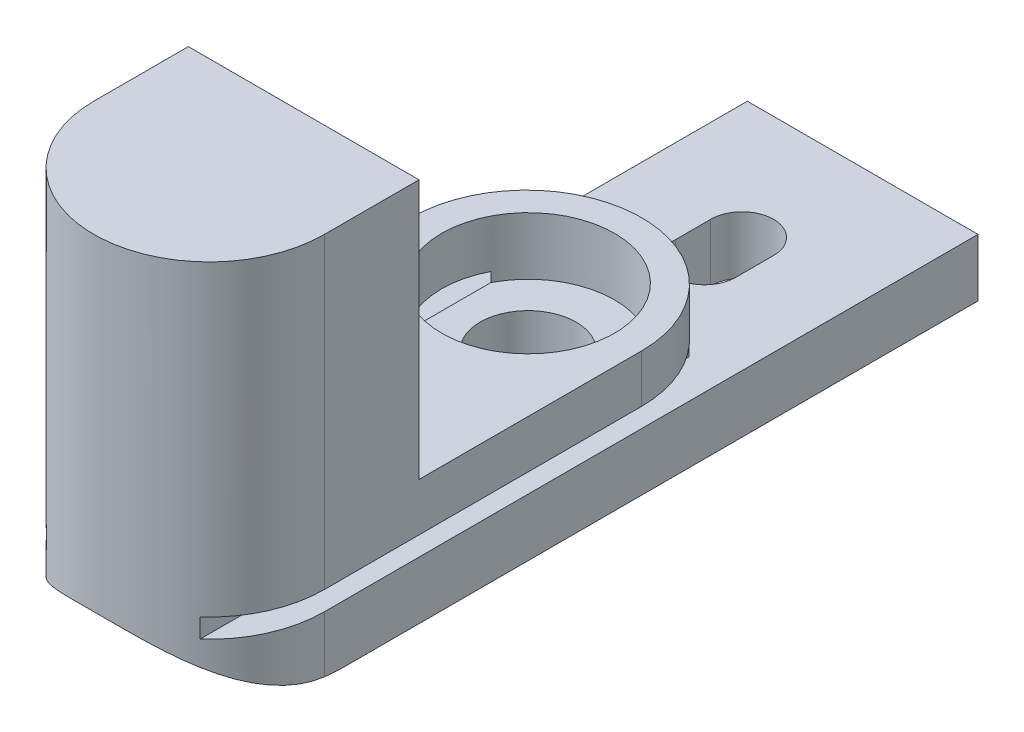
ISO-10303-21;
HEADER;
FILE_DESCRIPTION(('STEP AP214'),'2;1');
FILE_NAME('part.step','',(''),(''),'','','');
FILE_SCHEMA(('AUTOMOTIVE_DESIGN { 1 0 10303 214 1 1 1 1 }'));
ENDSEC;
DATA;
#1=APPLICATION_CONTEXT('core data for automotive mechanical design processes');
#2=APPLICATION_PROTOCOL_DEFINITION('international standard','automotive_design',2000,#1);
#3=PRODUCT_CONTEXT('',#1,'mechanical');
#4=PRODUCT('Part','Part','',(#3));
#5=PRODUCT_RELATED_PRODUCT_CATEGORY('part','',(#4));
#6=PRODUCT_DEFINITION_FORMATION('','',#4);
#7=PRODUCT_DEFINITION_CONTEXT('part definition',#1,'design');
#8=PRODUCT_DEFINITION('design','',#6,#7);
#9=PRODUCT_DEFINITION_SHAPE('','',#8);
#10=(LENGTH_UNIT() NAMED_UNIT(*) SI_UNIT(.MILLI.,.METRE.));
#11=(NAMED_UNIT(*) PLANE_ANGLE_UNIT() SI_UNIT($,.RADIAN.));
#12=(NAMED_UNIT(*) SI_UNIT($,.STERADIAN.) SOLID_ANGLE_UNIT());
#13=UNCERTAINTY_MEASURE_WITH_UNIT(LENGTH_MEASURE(1.E-05),#10,'distance_accuracy_value','');
#14=(GEOMETRIC_REPRESENTATION_CONTEXT(3) GLOBAL_UNCERTAINTY_ASSIGNED_CONTEXT((#13)) GLOBAL_UNIT_ASSIGNED_CONTEXT((#10,
#11,#12)) REPRESENTATION_CONTEXT('',''));
#15=CARTESIAN_POINT('',(0.,0.,0.));
#16=DIRECTION('',(0.,0.,1.));
#17=DIRECTION('',(1.,0.,0.));
#18=AXIS2_PLACEMENT_3D('',#15,#16,#17);
#19=CARTESIAN_POINT('',(6.0000000000003,1.5,40.));
#20=DIRECTION('',(-1.,0.,0.));
#21=DIRECTION('',(0.,-1.,0.));
#22=AXIS2_PLACEMENT_3D('',#19,#20,#21);
#23=PLANE('',#22);
#24=DIRECTION('',(0.,-1.,0.));
#25=VECTOR('',#24,1.);
#26=CARTESIAN_POINT('',(6.0000000000003,5.,34.0004316452496));
#27=LINE('',#26,#25);
#28=CARTESIAN_POINT('',(6.00000000000029,18.5,34.0004316452496));
#29=VERTEX_POINT('',#28);
#30=CARTESIAN_POINT('',(6.0000000000003,2.50000000000009,34.0004316452496));
#31=VERTEX_POINT('',#30);
#32=EDGE_CURVE('E286',#29,#31,#27,.T.);
#33=ORIENTED_EDGE('',*,*,#32,.T.);
#34=DIRECTION('',(0.,0.,-1.));
#35=VECTOR('',#34,1.);
#36=CARTESIAN_POINT('',(6.0000000000003,2.50000000000009,40.));
#37=LINE('',#36,#35);
#38=CARTESIAN_POINT('',(6.0000000000003,2.50000000000009,17.4956660275212));
#39=VERTEX_POINT('',#38);
#40=EDGE_CURVE('E613',#31,#39,#37,.T.);
#41=ORIENTED_EDGE('',*,*,#40,.T.);
#42=DIRECTION('',(0.,-1.,0.));
#43=VECTOR('',#42,1.);
#44=CARTESIAN_POINT('',(6.0000000000003,5.,17.4956660275212));
#45=LINE('',#44,#43);
#46=CARTESIAN_POINT('',(6.0000000000003,5.,17.4956660275212));
#47=VERTEX_POINT('',#46);
#48=EDGE_CURVE('E282',#47,#39,#45,.T.);
#49=ORIENTED_EDGE('',*,*,#48,.F.);
#50=DIRECTION('',(0.,0.,-1.));
#51=VECTOR('',#50,1.);
#52=CARTESIAN_POINT('',(6.0000000000003,5.,17.4956660275212));
#53=LINE('',#52,#51);
#54=CARTESIAN_POINT('',(6.0000000000003,5.,29.081568785258));
#55=VERTEX_POINT('',#54);
#56=EDGE_CURVE('E280',#55,#47,#53,.T.);
#57=ORIENTED_EDGE('',*,*,#56,.F.);
#58=DIRECTION('',(0.,-1.,0.));
#59=VECTOR('',#58,1.);
#60=CARTESIAN_POINT('',(6.00000000000029,18.5,29.081568785258));
#61=LINE('',#60,#59);
#62=CARTESIAN_POINT('',(6.00000000000029,18.5,29.081568785258));
#63=VERTEX_POINT('',#62);
#64=EDGE_CURVE('E459',#63,#55,#61,.T.);
#65=ORIENTED_EDGE('',*,*,#64,.F.);
#66=DIRECTION('',(0.,0.,-1.));
#67=VECTOR('',#66,1.);
#68=CARTESIAN_POINT('',(6.00000000000029,18.5,29.081568785258));
#69=LINE('',#68,#67);
#70=EDGE_CURVE('E477',#29,#63,#69,.T.);
#71=ORIENTED_EDGE('',*,*,#70,.F.);
#72=EDGE_LOOP('',(#33,#41,#49,#57,#65,#71));
#73=FACE_BOUND('',#72,.T.);
#74=ADVANCED_FACE('F42',(#73),#23,.F.);
#75=CARTESIAN_POINT('',(-6.,-1.5,40.));
#76=DIRECTION('',(1.,0.,0.));
#77=DIRECTION('',(0.,1.,0.));
#78=AXIS2_PLACEMENT_3D('',#75,#76,#77);
#79=PLANE('',#78);
#80=DIRECTION('',(0.,-1.,0.));
#81=VECTOR('',#80,1.);
#82=CARTESIAN_POINT('',(-6.00000000000024,5.,34.0004316452496));
#83=LINE('',#82,#81);
#84=CARTESIAN_POINT('',(-6.00000000000044,1.5,34.0004316452496));
#85=VERTEX_POINT('',#84);
#86=CARTESIAN_POINT('',(-6.00000000000001,-1.43451257162899,34.0004316452496));
#87=VERTEX_POINT('',#86);
#88=EDGE_CURVE('E290',#85,#87,#83,.T.);
#89=ORIENTED_EDGE('',*,*,#88,.F.);
#90=DIRECTION('',(0.,0.,-1.));
#91=VECTOR('',#90,1.);
#92=CARTESIAN_POINT('',(-6.,1.5,40.));
#93=LINE('',#92,#91);
#94=CARTESIAN_POINT('',(-6.,1.5,0.));
#95=VERTEX_POINT('',#94);
#96=EDGE_CURVE('E410',#85,#95,#93,.T.);
#97=ORIENTED_EDGE('',*,*,#96,.T.);
#98=DIRECTION('',(0.,-1.,0.));
#99=VECTOR('',#98,1.);
#100=CARTESIAN_POINT('',(-6.,-1.5,0.));
#101=LINE('',#100,#99);
#102=CARTESIAN_POINT('',(-6.,-1.5,0.));
#103=VERTEX_POINT('',#102);
#104=EDGE_CURVE('E397',#95,#103,#101,.T.);
#105=ORIENTED_EDGE('',*,*,#104,.T.);
#106=DIRECTION('',(0.,0.,-1.));
#107=VECTOR('',#106,1.);
#108=CARTESIAN_POINT('',(-6.,-1.5,40.));
#109=LINE('',#108,#107);
#110=CARTESIAN_POINT('',(-6.,-1.5,32.857864376269));
#111=VERTEX_POINT('',#110);
#112=EDGE_CURVE('E407',#111,#103,#109,.T.);
#113=ORIENTED_EDGE('',*,*,#112,.F.);
#114=CARTESIAN_POINT('',(-6.00000000000001,8.5,32.857864376269));
#115=DIRECTION('',(1.,0.,0.));
#116=DIRECTION('',(0.,1.,0.));
#117=AXIS2_PLACEMENT_3D('',#114,#115,#116);
#118=CIRCLE('',#117,10.);
#119=EDGE_CURVE('E354',#111,#87,#118,.F.);
#120=ORIENTED_EDGE('',*,*,#119,.T.);
#121=EDGE_LOOP('',(#89,#97,#105,#113,#120));
#122=FACE_BOUND('',#121,.T.);
#123=ADVANCED_FACE('F426',(#122),#79,.F.);
#124=CARTESIAN_POINT('',(-6.00000000000024,18.5,29.081568785258));
#125=DIRECTION('',(0.,0.,1.));
#126=DIRECTION('',(1.,0.,0.));
#127=AXIS2_PLACEMENT_3D('',#124,#125,#126);
#128=PLANE('',#127);
#129=DIRECTION('',(0.,-1.,0.));
#130=VECTOR('',#129,1.);
#131=CARTESIAN_POINT('',(0.500000000000291,18.5,29.081568785258));
#132=LINE('',#131,#130);
#133=CARTESIAN_POINT('',(0.500000000000294,13.,29.081568785258));
#134=VERTEX_POINT('',#133);
#135=CARTESIAN_POINT('',(0.500000000000299,5.,29.081568785258));
#136=VERTEX_POINT('',#135);
#137=EDGE_CURVE('E562',#134,#136,#132,.T.);
#138=ORIENTED_EDGE('',*,*,#137,.F.);
#139=DIRECTION('',(-1.,0.,0.));
#140=VECTOR('',#139,1.);
#141=CARTESIAN_POINT('',(-6.00000000000024,13.,29.081568785258));
#142=LINE('',#141,#140);
#143=CARTESIAN_POINT('',(-0.500000000000008,13.,29.081568785258));
#144=VERTEX_POINT('',#143);
#145=EDGE_CURVE('E551',#134,#144,#142,.T.);
#146=ORIENTED_EDGE('',*,*,#145,.T.);
#147=DIRECTION('',(0.,-1.,0.));
#148=VECTOR('',#147,1.);
#149=CARTESIAN_POINT('',(-0.500000000000004,-1.5,29.081568785258));
#150=LINE('',#149,#148);
#151=CARTESIAN_POINT('',(-0.500000000000006,5.,29.081568785258));
#152=VERTEX_POINT('',#151);
#153=EDGE_CURVE('E557',#144,#152,#150,.T.);
#154=ORIENTED_EDGE('',*,*,#153,.T.);
#155=DIRECTION('',(-1.,0.,0.));
#156=VECTOR('',#155,1.);
#157=CARTESIAN_POINT('',(-6.00000000000024,5.,29.081568785258));
#158=LINE('',#157,#156);
#159=CARTESIAN_POINT('',(-6.00000000000024,5.,29.081568785258));
#160=VERTEX_POINT('',#159);
#161=EDGE_CURVE('E474',#152,#160,#158,.T.);
#162=ORIENTED_EDGE('',*,*,#161,.T.);
#163=DIRECTION('',(0.,-1.,0.));
#164=VECTOR('',#163,1.);
#165=CARTESIAN_POINT('',(-6.00000000000024,18.5,29.081568785258));
#166=LINE('',#165,#164);
#167=CARTESIAN_POINT('',(-6.00000000000024,18.5,29.081568785258));
#168=VERTEX_POINT('',#167);
#169=EDGE_CURVE('E463',#168,#160,#166,.T.);
#170=ORIENTED_EDGE('',*,*,#169,.F.);
#171=DIRECTION('',(-1.,0.,0.));
#172=VECTOR('',#171,1.);
#173=CARTESIAN_POINT('',(-6.00000000000024,18.5,29.081568785258));
#174=LINE('',#173,#172);
#175=EDGE_CURVE('E467',#63,#168,#174,.T.);
#176=ORIENTED_EDGE('',*,*,#175,.F.);
#177=ORIENTED_EDGE('',*,*,#64,.T.);
#178=EDGE_CURVE('E468',#55,#136,#158,.T.);
#179=ORIENTED_EDGE('',*,*,#178,.T.);
#180=EDGE_LOOP('',(#138,#146,#154,#162,#170,#176,#177,#179));
#181=FACE_BOUND('',#180,.T.);
#182=ADVANCED_FACE('F449',(#181),#128,.F.);
#183=CARTESIAN_POINT('',(0.,-8.5,17.4039561044392));
#184=DIRECTION('',(0.,1.,0.));
#185=DIRECTION('',(-1.,0.,0.));
#186=AXIS2_PLACEMENT_3D('',#183,#184,#185);
#187=CYLINDRICAL_SURFACE('',#186,2.5);
#188=CARTESIAN_POINT('',(0.,-1.5,17.4039561044392));
#189=DIRECTION('',(0.,1.,0.));
#190=DIRECTION('',(-1.,0.,0.));
#191=AXIS2_PLACEMENT_3D('',#188,#189,#190);
#192=CIRCLE('',#191,2.5);
#193=CARTESIAN_POINT('',(-2.5,-1.5,17.4039561044392));
#194=VERTEX_POINT('',#193);
#195=EDGE_CURVE('E347',#194,#194,#192,.T.);
#196=ORIENTED_EDGE('',*,*,#195,.F.);
#197=EDGE_LOOP('',(#196));
#198=FACE_BOUND('',#197,.T.);
#199=CARTESIAN_POINT('',(0.,2.,17.4039561044392));
#200=DIRECTION('',(0.,1.,0.));
#201=DIRECTION('',(-1.,0.,0.));
#202=AXIS2_PLACEMENT_3D('',#199,#200,#201);
#203=CIRCLE('',#202,2.5);
#204=CARTESIAN_POINT('',(-2.5,2.,17.4039561044392));
#205=VERTEX_POINT('',#204);
#206=EDGE_CURVE('E338',#205,#205,#203,.F.);
#207=ORIENTED_EDGE('',*,*,#206,.F.);
#208=EDGE_LOOP('',(#207));
#209=FACE_BOUND('',#208,.T.);
#210=ADVANCED_FACE('F717',(#198,#209),#187,.F.);
#211=DIRECTION('',(0.,0.,-1.));
#212=VECTOR('',#211,1.);
#213=CARTESIAN_POINT('',(6.0000000000003,1.5,40.));
#214=LINE('',#213,#212);
#215=CARTESIAN_POINT('',(5.99999999999988,1.50000000000002,34.0004316452496));
#216=VERTEX_POINT('',#215);
#217=CARTESIAN_POINT('',(6.0000000000003,1.5,0.));
#218=VERTEX_POINT('',#217);
#219=EDGE_CURVE('E378',#216,#218,#214,.T.);
#220=ORIENTED_EDGE('',*,*,#219,.F.);
#221=CARTESIAN_POINT('',(6.0000000000003,-1.43451257162898,34.0004316452496));
#222=VERTEX_POINT('',#221);
#223=EDGE_CURVE('E285',#216,#222,#27,.T.);
#224=ORIENTED_EDGE('',*,*,#223,.T.);
#225=CARTESIAN_POINT('',(6.00000000000029,8.5,32.857864376269));
#226=DIRECTION('',(-1.,0.,0.));
#227=DIRECTION('',(0.,-1.,0.));
#228=AXIS2_PLACEMENT_3D('',#225,#226,#227);
#229=CIRCLE('',#228,10.);
#230=CARTESIAN_POINT('',(6.0000000000003,-1.5,32.857864376269));
#231=VERTEX_POINT('',#230);
#232=EDGE_CURVE('E417',#222,#231,#229,.F.);
#233=ORIENTED_EDGE('',*,*,#232,.T.);
#234=DIRECTION('',(0.,0.,-1.));
#235=VECTOR('',#234,1.);
#236=CARTESIAN_POINT('',(6.0000000000003,-1.5,40.));
#237=LINE('',#236,#235);
#238=CARTESIAN_POINT('',(6.0000000000003,-1.5,0.));
#239=VERTEX_POINT('',#238);
#240=EDGE_CURVE('E384',#231,#239,#237,.T.);
#241=ORIENTED_EDGE('',*,*,#240,.T.);
#242=DIRECTION('',(0.,1.,0.));
#243=VECTOR('',#242,1.);
#244=CARTESIAN_POINT('',(6.0000000000003,1.5,0.));
#245=LINE('',#244,#243);
#246=EDGE_CURVE('E387',#239,#218,#245,.T.);
#247=ORIENTED_EDGE('',*,*,#246,.T.);
#248=EDGE_LOOP('',(#220,#224,#233,#241,#247));
#249=FACE_BOUND('',#248,.T.);
#250=ADVANCED_FACE('F329',(#249),#23,.F.);
#251=CARTESIAN_POINT('',(-28.9999999999997,1.49999999999998,40.));
#252=DIRECTION('',(0.,-0.707106781186556,0.707106781186539));
#253=DIRECTION('',(0.,-0.707106781186539,-0.707106781186556));
#254=AXIS2_PLACEMENT_3D('',#251,#252,#253);
#255=PLANE('',#254);
#256=CARTESIAN_POINT('',(0.0719691370001732,1.5,40.));
#257=DIRECTION('',(-1.,0.,0.));
#258=VECTOR('',#257,1.);
#259=LINE('',#256,#258);
#260=CARTESIAN_POINT('',(0.0719691370001598,1.5,40.));
#261=VERTEX_POINT('',#260);
#262=CARTESIAN_POINT('',(-0.071969137000094,1.5,40.));
#263=VERTEX_POINT('',#262);
#264=EDGE_CURVE('E304',#261,#263,#259,.T.);
#265=ORIENTED_EDGE('',*,*,#264,.T.);
#266=CARTESIAN_POINT('',(0.,-4.49956835475027,34.0004316452496));
#267=DIRECTION('',(0.,-0.707106781186556,0.707106781186539));
#268=DIRECTION('',(0.,0.707106781186539,0.707106781186556));
#269=AXIS2_PLACEMENT_3D('',#266,#267,#268);
#270=ELLIPSE('',#269,8.48528137423884,6.00000000000027);
#271=CARTESIAN_POINT('',(-0.923515735121575,1.42893218813443,39.9289321881344));
#272=VERTEX_POINT('',#271);
#273=EDGE_CURVE('E268',#263,#272,#270,.T.);
#274=ORIENTED_EDGE('',*,*,#273,.T.);
#275=DIRECTION('',(1.,0.,0.));
#276=VECTOR('',#275,1.);
#277=CARTESIAN_POINT('',(6.00000000000031,1.42893218813444,39.9289321881344));
#278=LINE('',#277,#276);
#279=CARTESIAN_POINT('',(0.923515735121654,1.42893218813443,39.9289321881344));
#280=VERTEX_POINT('',#279);
#281=EDGE_CURVE('E413',#272,#280,#278,.T.);
#282=ORIENTED_EDGE('',*,*,#281,.T.);
#283=CARTESIAN_POINT('',(0.,-4.49956835475027,34.0004316452496));
#284=DIRECTION('',(0.,-0.707106781186556,0.707106781186539));
#285=DIRECTION('',(0.,0.707106781186539,0.707106781186556));
#286=AXIS2_PLACEMENT_3D('',#283,#284,#285);
#287=ELLIPSE('',#286,8.48528137423884,6.00000000000027);
#288=EDGE_CURVE('E434',#280,#261,#287,.T.);
#289=ORIENTED_EDGE('',*,*,#288,.T.);
#290=EDGE_LOOP('',(#265,#274,#282,#289));
#291=FACE_BOUND('',#290,.T.);
#292=ADVANCED_FACE('F325',(#291),#255,.T.);
#293=CARTESIAN_POINT('',(-28.9999999999997,8.49999999999999,32.8578643762691));
#294=DIRECTION('',(-1.,0.,0.));
#295=DIRECTION('',(0.,0.,1.));
#296=AXIS2_PLACEMENT_3D('',#293,#294,#295);
#297=CYLINDRICAL_SURFACE('',#296,10.);
#298=ORIENTED_EDGE('',*,*,#281,.F.);
#299=CARTESIAN_POINT('',(-0.923515735121575,1.42893218813443,39.9289321881344));
#300=CARTESIAN_POINT('',(-1.08337877441369,1.40407330660812,39.9040408148903));
#301=CARTESIAN_POINT('',(-1.24105485999906,1.37310700867023,39.8728450985981));
#302=CARTESIAN_POINT('',(-1.55085500013304,1.30087887362925,39.7987182394069));
#303=CARTESIAN_POINT('',(-1.70299022958298,1.25963924425524,39.7558123912702));
#304=CARTESIAN_POINT('',(-2.14747717321664,1.12404556831204,39.6115601687209));
#305=CARTESIAN_POINT('',(-2.43100300523044,1.01726828793097,39.4941695513238));
#306=CARTESIAN_POINT('',(-2.83424555599602,0.843409535292543,39.2909471702004));
#307=CARTESIAN_POINT('',(-2.96455115948893,0.783417110566074,39.2189938359256));
#308=CARTESIAN_POINT('',(-3.21833756583385,0.660133087239375,39.0664154835463));
#309=CARTESIAN_POINT('',(-3.34181960775425,0.596842091698747,38.9857920477026));
#310=CARTESIAN_POINT('',(-3.70265613148268,0.403524649304746,38.7308968513988));
#311=CARTESIAN_POINT('',(-3.9296407313693,0.270395868037782,38.5439869339421));
#312=CARTESIAN_POINT('',(-4.27006153464762,0.0573921471041408,38.2192001721445));
#313=CARTESIAN_POINT('',(-4.39292718057151,-0.0227411941077327,38.0911282319545));
#314=CARTESIAN_POINT('',(-4.62739712174493,-0.181171780481165,37.8238837479329));
#315=CARTESIAN_POINT('',(-4.73899963067735,-0.25946873288736,37.6847094495307));
#316=CARTESIAN_POINT('',(-4.95005205112926,-0.412534779588411,37.3958627000051));
#317=CARTESIAN_POINT('',(-5.04951358256302,-0.487307204388185,37.2462005061213));
#318=CARTESIAN_POINT('',(-5.23548962988464,-0.631894266558084,36.9367909721312));
#319=CARTESIAN_POINT('',(-5.32200752261812,-0.701710194514569,36.7770462779505));
#320=CARTESIAN_POINT('',(-5.46720075213527,-0.823340360762042,36.4768155341881));
#321=CARTESIAN_POINT('',(-5.52810128501332,-0.876173165689279,36.3378147972673));
#322=CARTESIAN_POINT('',(-5.63969599580189,-0.976680864165725,36.0539827785454));
#323=CARTESIAN_POINT('',(-5.69039206404903,-1.02435671226234,35.9091525826044));
#324=CARTESIAN_POINT('',(-5.78083249488694,-1.11373184238338,35.6146366528976));
#325=CARTESIAN_POINT('',(-5.82059759083708,-1.15544236601678,35.4649607218387));
#326=CARTESIAN_POINT('',(-5.88865447312645,-1.23232073918606,35.161434154546));
#327=CARTESIAN_POINT('',(-5.91695134531053,-1.26749148518185,35.0075854012126));
#328=CARTESIAN_POINT('',(-5.95931300863245,-1.32761048865925,34.7121704868586));
#329=CARTESIAN_POINT('',(-5.97451251106378,-1.35322722133399,34.5709027217115));
#330=CARTESIAN_POINT('',(-5.99486516688345,-1.39844724494483,34.2866974120463));
#331=CARTESIAN_POINT('',(-6.00001851210994,-1.41805065070343,34.1437598994654));
#332=CARTESIAN_POINT('',(-6.00000000000023,-1.43451257162899,34.0004316452496));
#333=B_SPLINE_CURVE_WITH_KNOTS('',3,(#299,#300,#301,#302,#303,#304,#305,#306,#307,#308,#309,
#310,#311,#312,#313,#314,#315,#316,#317,#318,#319,#320,#321,#322,#323,#324,#325,#326,#327,#328,
#329,#330,#331,#332),.UNSPECIFIED.,.F.,.F.,(4,2,2,2,2,2,2,2,2,2,2,2,2,2,2,2,4),(0.,
0.490408206639217,0.979765366091119,1.94908678226946,2.43026144248439,2.91134843867993,
3.87625620537725,4.45992418284957,5.04368458421919,5.62688182381307,6.20992664767081,
6.69152349422979,7.17303104461025,7.65361889113589,8.13399337621527,8.56663952456514,
8.9992774111642),.UNSPECIFIED.);
#334=EDGE_CURVE('E276',#272,#87,#333,.T.);
#335=ORIENTED_EDGE('',*,*,#334,.T.);
#336=ORIENTED_EDGE('',*,*,#119,.F.);
#337=DIRECTION('',(1.,0.,0.));
#338=VECTOR('',#337,1.);
#339=CARTESIAN_POINT('',(-6.00000000000001,-1.5,32.857864376269));
#340=LINE('',#339,#338);
#341=EDGE_CURVE('E420',#231,#111,#340,.F.);
#342=ORIENTED_EDGE('',*,*,#341,.F.);
#343=ORIENTED_EDGE('',*,*,#232,.F.);
#344=CARTESIAN_POINT('',(6.0000000000003,-1.43451257162899,34.0004316452496));
#345=CARTESIAN_POINT('',(6.00002942586994,-1.4161622488301,34.1602907998334));
#346=CARTESIAN_POINT('',(5.99361304097424,-1.39389005872717,34.3196616006231));
#347=CARTESIAN_POINT('',(5.96833595868183,-1.34192439930189,34.6360714699046));
#348=CARTESIAN_POINT('',(5.94948475306771,-1.31223660121341,34.7931122235595));
#349=CARTESIAN_POINT('',(5.8999403989253,-1.2460418714054,35.1027772299175));
#350=CARTESIAN_POINT('',(5.86932250548455,-1.20957902056244,35.2554230539707));
#351=CARTESIAN_POINT('',(5.79681984161925,-1.13028906025063,35.5563338201298));
#352=CARTESIAN_POINT('',(5.75493328961153,-1.0874609449084,35.7045980653875));
#353=CARTESIAN_POINT('',(5.66067471436859,-0.996250489361664,35.9954400142396));
#354=CARTESIAN_POINT('',(5.60833522986025,-0.947885579127685,36.1380337574878));
#355=CARTESIAN_POINT('',(5.49373878860613,-0.846227201178037,36.4173824753575));
#356=CARTESIAN_POINT('',(5.43147804124198,-0.792931852966928,36.5541351928713));
#357=CARTESIAN_POINT('',(5.23065677731652,-0.626715824758168,36.9550109724446));
#358=CARTESIAN_POINT('',(5.07808703251586,-0.507494175742646,37.2096613923656));
#359=CARTESIAN_POINT('',(4.72177188813327,-0.245347880091875,37.7167953256436));
#360=CARTESIAN_POINT('',(4.51425203024088,-0.101257262553926,37.9659880008121));
#361=CARTESIAN_POINT('',(4.06242311122676,0.190321784616228,38.4277677624567));
#362=CARTESIAN_POINT('',(3.81802235821658,0.337817884185463,38.6402607015787));
#363=CARTESIAN_POINT('',(3.40764605906989,0.562851703112655,38.9423126876545));
#364=CARTESIAN_POINT('',(3.25305994492819,0.643232912947078,39.0454784759487));
#365=CARTESIAN_POINT('',(2.93289992933466,0.798825125611564,39.2380838977087));
#366=CARTESIAN_POINT('',(2.76732123237662,0.874033842428137,39.3275174833973));
#367=CARTESIAN_POINT('',(2.42654361913524,1.01589164468206,39.4910982951095));
#368=CARTESIAN_POINT('',(2.25140282918045,1.0825856724321,39.5653271486182));
#369=CARTESIAN_POINT('',(1.89146054127707,1.20448508523211,39.6977154743106));
#370=CARTESIAN_POINT('',(1.70667273727355,1.25970622949995,39.755897025651));
#371=CARTESIAN_POINT('',(1.42076509348706,1.3319136948364,39.8306533481219));
#372=CARTESIAN_POINT('',(1.3226885752488,1.35442949142834,39.8536974362887));
#373=CARTESIAN_POINT('',(1.12452023560525,1.39508584522842,39.8949813560065));
#374=CARTESIAN_POINT('',(1.02442627360438,1.41322145794191,39.9132157603472));
#375=CARTESIAN_POINT('',(0.923515735121666,1.42893218813444,39.9289321881344));
#376=B_SPLINE_CURVE_WITH_KNOTS('',3,(#344,#345,#346,#347,#348,#349,#350,#351,#352,#353,#354,
#355,#356,#357,#358,#359,#360,#361,#362,#363,#364,#365,#366,#367,#368,#369,#370,#371,#372,#373,
#374,#375),.UNSPECIFIED.,.F.,.F.,(4,2,2,2,2,2,2,2,2,2,2,2,2,2,2,4),(0.,0.482495009030473,
0.964622144139095,1.4437157641571,1.92288517378605,2.40058560507328,2.87846899098924,
3.83453078593531,4.89528530330681,5.95872185321501,6.56550629658524,7.17255721112085,
7.77625839938141,8.37912477624592,8.68862272096089,8.99846842106345),.UNSPECIFIED.);
#377=EDGE_CURVE('E437',#222,#280,#376,.T.);
#378=ORIENTED_EDGE('',*,*,#377,.T.);
#379=EDGE_LOOP('',(#298,#335,#336,#342,#343,#378));
#380=FACE_BOUND('',#379,.T.);
#381=ADVANCED_FACE('F44',(#380),#297,.T.);
#382=CARTESIAN_POINT('',(-6.,1.5,40.));
#383=DIRECTION('',(0.,-1.,0.));
#384=DIRECTION('',(1.,0.,0.));
#385=AXIS2_PLACEMENT_3D('',#382,#383,#384);
#386=PLANE('',#385);
#387=DIRECTION('',(0.,0.,-1.));
#388=VECTOR('',#387,1.);
#389=CARTESIAN_POINT('',(1.63500000000003,1.5,8.14241944835968));
#390=LINE('',#389,#388);
#391=CARTESIAN_POINT('',(1.63500000000003,1.5,8.14241944835967));
#392=VERTEX_POINT('',#391);
#393=CARTESIAN_POINT('',(1.63500000000003,1.5,6.27065642873256));
#394=VERTEX_POINT('',#393);
#395=EDGE_CURVE('E521',#392,#394,#390,.T.);
#396=ORIENTED_EDGE('',*,*,#395,.F.);
#397=CARTESIAN_POINT('',(0.,1.5,8.23144074245807));
#398=DIRECTION('',(0.,1.,0.));
#399=DIRECTION('',(-1.,0.,0.));
#400=AXIS2_PLACEMENT_3D('',#397,#398,#399);
#401=CIRCLE('',#400,1.63742168997572);
#402=CARTESIAN_POINT('',(-1.63297385620914,1.5,8.11083321474809));
#403=VERTEX_POINT('',#402);
#404=EDGE_CURVE('E525',#403,#392,#401,.T.);
#405=ORIENTED_EDGE('',*,*,#404,.F.);
#406=DIRECTION('',(0.,0.,1.));
#407=VECTOR('',#406,1.);
#408=CARTESIAN_POINT('',(-1.63297385620914,1.5,6.27065642873259));
#409=LINE('',#408,#407);
#410=CARTESIAN_POINT('',(-1.63297385620914,1.5,6.27065642873257));
#411=VERTEX_POINT('',#410);
#412=EDGE_CURVE('E512',#411,#403,#409,.T.);
#413=ORIENTED_EDGE('',*,*,#412,.F.);
#414=CARTESIAN_POINT('',(0.00101307189544751,1.5,6.27065642873257));
#415=DIRECTION('',(0.,1.,0.));
#416=DIRECTION('',(-1.,0.,0.));
#417=AXIS2_PLACEMENT_3D('',#414,#415,#416);
#418=CIRCLE('',#417,1.63398692810458);
#419=EDGE_CURVE('E517',#394,#411,#418,.T.);
#420=ORIENTED_EDGE('',*,*,#419,.F.);
#421=EDGE_LOOP('',(#396,#405,#413,#420));
#422=FACE_BOUND('',#421,.T.);
#423=DIRECTION('',(-1.,0.,0.));
#424=VECTOR('',#423,1.);
#425=CARTESIAN_POINT('',(-6.,1.5,0.));
#426=LINE('',#425,#424);
#427=EDGE_CURVE('E299',#218,#95,#426,.T.);
#428=ORIENTED_EDGE('',*,*,#427,.T.);
#429=ORIENTED_EDGE('',*,*,#96,.F.);
#430=CARTESIAN_POINT('',(0.,1.5,34.0004316452496));
#431=DIRECTION('',(0.,-1.,0.));
#432=DIRECTION('',(0.,0.,-1.));
#433=AXIS2_PLACEMENT_3D('',#430,#431,#432);
#434=CIRCLE('',#433,6.00000000000027);
#435=CARTESIAN_POINT('',(-4.00000000000046,1.5,38.472567600249));
#436=VERTEX_POINT('',#435);
#437=EDGE_CURVE('E12',#436,#85,#434,.T.);
#438=ORIENTED_EDGE('',*,*,#437,.F.);
#439=DIRECTION('',(0.,0.,-1.));
#440=VECTOR('',#439,1.);
#441=CARTESIAN_POINT('',(-4.00000000000046,1.5,40.0029356444242));
#442=LINE('',#441,#440);
#443=CARTESIAN_POINT('',(-4.00000000000046,1.5,13.0235300725218));
#444=VERTEX_POINT('',#443);
#445=EDGE_CURVE('E265',#436,#444,#442,.T.);
#446=ORIENTED_EDGE('',*,*,#445,.T.);
#447=CARTESIAN_POINT('',(0.,1.5,17.4956660275212));
#448=DIRECTION('',(0.,1.,0.));
#449=DIRECTION('',(-1.,0.,0.));
#450=AXIS2_PLACEMENT_3D('',#447,#448,#449);
#451=CIRCLE('',#450,6.00000000000027);
#452=CARTESIAN_POINT('',(4.00000000000017,1.50000000000017,13.0235300725214));
#453=VERTEX_POINT('',#452);
#454=EDGE_CURVE('E256',#453,#444,#451,.T.);
#455=ORIENTED_EDGE('',*,*,#454,.F.);
#456=DIRECTION('',(0.,0.,-1.));
#457=VECTOR('',#456,1.);
#458=CARTESIAN_POINT('',(4.00000000000017,1.50000000000017,40.0029356444242));
#459=LINE('',#458,#457);
#460=CARTESIAN_POINT('',(4.00000000000017,1.50000000000017,38.4725676002494));
#461=VERTEX_POINT('',#460);
#462=EDGE_CURVE('E67',#461,#453,#459,.T.);
#463=ORIENTED_EDGE('',*,*,#462,.F.);
#464=CARTESIAN_POINT('',(0.,1.50000000000045,34.0004316452496));
#465=DIRECTION('',(0.,-1.,0.));
#466=DIRECTION('',(1.,0.,0.));
#467=AXIS2_PLACEMENT_3D('',#464,#465,#466);
#468=CIRCLE('',#467,6.00000000000027);
#469=EDGE_CURVE('E52',#216,#461,#468,.T.);
#470=ORIENTED_EDGE('',*,*,#469,.F.);
#471=ORIENTED_EDGE('',*,*,#219,.T.);
#472=EDGE_LOOP('',(#428,#429,#438,#446,#455,#463,#470,#471));
#473=FACE_BOUND('',#472,.T.);
#474=ADVANCED_FACE('F263',(#422,#473),#386,.F.);
#475=DIRECTION('',(0.,-1.,0.));
#476=VECTOR('',#475,1.);
#477=CARTESIAN_POINT('',(-6.00000000000024,5.,17.4956660275212));
#478=LINE('',#477,#476);
#479=CARTESIAN_POINT('',(-6.00000000000024,5.,17.4956660275212));
#480=VERTEX_POINT('',#479);
#481=CARTESIAN_POINT('',(-6.,2.50000000000006,17.4956660275212));
#482=VERTEX_POINT('',#481);
#483=EDGE_CURVE('E295',#480,#482,#478,.T.);
#484=ORIENTED_EDGE('',*,*,#483,.T.);
#485=DIRECTION('',(0.,0.,1.));
#486=VECTOR('',#485,1.);
#487=CARTESIAN_POINT('',(-6.,2.50000000000006,40.));
#488=LINE('',#487,#486);
#489=CARTESIAN_POINT('',(-6.00000000000023,2.50000000000006,34.0004316452496));
#490=VERTEX_POINT('',#489);
#491=EDGE_CURVE('E603',#482,#490,#488,.T.);
#492=ORIENTED_EDGE('',*,*,#491,.T.);
#493=CARTESIAN_POINT('',(-6.00000000000024,18.5,34.0004316452496));
#494=VERTEX_POINT('',#493);
#495=EDGE_CURVE('E291',#494,#490,#83,.T.);
#496=ORIENTED_EDGE('',*,*,#495,.F.);
#497=DIRECTION('',(0.,0.,1.));
#498=VECTOR('',#497,1.);
#499=CARTESIAN_POINT('',(-6.00000000000024,18.5,34.0004316452496));
#500=LINE('',#499,#498);
#501=EDGE_CURVE('E472',#168,#494,#500,.T.);
#502=ORIENTED_EDGE('',*,*,#501,.F.);
#503=ORIENTED_EDGE('',*,*,#169,.T.);
#504=DIRECTION('',(0.,0.,1.));
#505=VECTOR('',#504,1.);
#506=CARTESIAN_POINT('',(-6.00000000000024,5.,17.4956660275212));
#507=LINE('',#506,#505);
#508=EDGE_CURVE('E273',#480,#160,#507,.T.);
#509=ORIENTED_EDGE('',*,*,#508,.F.);
#510=EDGE_LOOP('',(#484,#492,#496,#502,#503,#509));
#511=FACE_BOUND('',#510,.T.);
#512=ADVANCED_FACE('F691',(#511),#79,.F.);
#513=CARTESIAN_POINT('',(6.0000000000003,-1.5,40.));
#514=DIRECTION('',(0.,1.,0.));
#515=DIRECTION('',(-1.,0.,0.));
#516=AXIS2_PLACEMENT_3D('',#513,#514,#515);
#517=PLANE('',#516);
#518=DIRECTION('',(0.,0.,1.));
#519=VECTOR('',#518,1.);
#520=CARTESIAN_POINT('',(-1.63297385620913,-1.50000000000001,6.27065642873259));
#521=LINE('',#520,#519);
#522=CARTESIAN_POINT('',(-1.63297385620913,-1.50000000000001,6.27065642873257));
#523=VERTEX_POINT('',#522);
#524=CARTESIAN_POINT('',(-1.63297385620913,-1.50000000000001,8.11083321474809));
#525=VERTEX_POINT('',#524);
#526=EDGE_CURVE('E504',#523,#525,#521,.T.);
#527=ORIENTED_EDGE('',*,*,#526,.T.);
#528=CARTESIAN_POINT('',(0.,-1.50000000000001,8.23144074245807));
#529=DIRECTION('',(0.,1.,0.));
#530=DIRECTION('',(-1.,0.,0.));
#531=AXIS2_PLACEMENT_3D('',#528,#529,#530);
#532=CIRCLE('',#531,1.63742168997572);
#533=CARTESIAN_POINT('',(1.63500000000003,-1.50000000000001,8.14241944835968));
#534=VERTEX_POINT('',#533);
#535=EDGE_CURVE('E516',#525,#534,#532,.T.);
#536=ORIENTED_EDGE('',*,*,#535,.T.);
#537=DIRECTION('',(0.,0.,-1.));
#538=VECTOR('',#537,1.);
#539=CARTESIAN_POINT('',(1.63500000000003,-1.50000000000001,8.14241944835968));
#540=LINE('',#539,#538);
#541=CARTESIAN_POINT('',(1.63500000000003,-1.5,6.27065642873257));
#542=VERTEX_POINT('',#541);
#543=EDGE_CURVE('E536',#534,#542,#540,.T.);
#544=ORIENTED_EDGE('',*,*,#543,.T.);
#545=CARTESIAN_POINT('',(0.00101307189544859,-1.50000000000001,6.27065642873257));
#546=DIRECTION('',(0.,1.,0.));
#547=DIRECTION('',(-1.,0.,0.));
#548=AXIS2_PLACEMENT_3D('',#545,#546,#547);
#549=CIRCLE('',#548,1.63398692810458);
#550=EDGE_CURVE('E532',#542,#523,#549,.T.);
#551=ORIENTED_EDGE('',*,*,#550,.T.);
#552=EDGE_LOOP('',(#527,#536,#544,#551));
#553=FACE_BOUND('',#552,.T.);
#554=ORIENTED_EDGE('',*,*,#195,.T.);
#555=EDGE_LOOP('',(#554));
#556=FACE_BOUND('',#555,.T.);
#557=ORIENTED_EDGE('',*,*,#240,.F.);
#558=ORIENTED_EDGE('',*,*,#341,.T.);
#559=ORIENTED_EDGE('',*,*,#112,.T.);
#560=DIRECTION('',(1.,0.,0.));
#561=VECTOR('',#560,1.);
#562=CARTESIAN_POINT('',(6.0000000000003,-1.5,0.));
#563=LINE('',#562,#561);
#564=EDGE_CURVE('E393',#103,#239,#563,.T.);
#565=ORIENTED_EDGE('',*,*,#564,.T.);
#566=EDGE_LOOP('',(#557,#558,#559,#565));
#567=FACE_BOUND('',#566,.T.);
#568=ADVANCED_FACE('F702',(#553,#556,#567),#517,.F.);
#569=CARTESIAN_POINT('',(0.,0.,0.));
#570=DIRECTION('',(0.,0.,-1.));
#571=DIRECTION('',(-1.,0.,0.));
#572=AXIS2_PLACEMENT_3D('',#569,#570,#571);
#573=PLANE('',#572);
#574=ORIENTED_EDGE('',*,*,#427,.F.);
#575=ORIENTED_EDGE('',*,*,#246,.F.);
#576=ORIENTED_EDGE('',*,*,#564,.F.);
#577=ORIENTED_EDGE('',*,*,#104,.F.);
#578=EDGE_LOOP('',(#574,#575,#576,#577));
#579=FACE_BOUND('',#578,.T.);
#580=ADVANCED_FACE('F324',(#579),#573,.T.);
#581=CARTESIAN_POINT('',(0.,5.,17.4956660275212));
#582=DIRECTION('',(0.,-1.,0.));
#583=DIRECTION('',(1.,0.,0.));
#584=AXIS2_PLACEMENT_3D('',#581,#582,#583);
#585=CYLINDRICAL_SURFACE('',#584,6.00000000000027);
#586=ORIENTED_EDGE('',*,*,#454,.T.);
#587=DIRECTION('',(0.,-1.,0.));
#588=VECTOR('',#587,1.);
#589=CARTESIAN_POINT('',(-4.00000000000052,4.99999999999994,13.0235300725218));
#590=LINE('',#589,#588);
#591=CARTESIAN_POINT('',(-4.00000000000048,2.50000000000005,13.0235300725218));
#592=VERTEX_POINT('',#591);
#593=EDGE_CURVE('E571',#444,#592,#590,.F.);
#594=ORIENTED_EDGE('',*,*,#593,.T.);
#595=CARTESIAN_POINT('',(0.,2.50000000000005,17.4956660275212));
#596=DIRECTION('',(0.,1.,0.));
#597=DIRECTION('',(-1.,0.,0.));
#598=AXIS2_PLACEMENT_3D('',#595,#596,#597);
#599=CIRCLE('',#598,6.00000000000027);
#600=EDGE_CURVE('E599',#592,#482,#599,.T.);
#601=ORIENTED_EDGE('',*,*,#600,.T.);
#602=ORIENTED_EDGE('',*,*,#483,.F.);
#603=CARTESIAN_POINT('',(0.,5.,17.4956660275212));
#604=DIRECTION('',(0.,1.,0.));
#605=DIRECTION('',(-1.,0.,0.));
#606=AXIS2_PLACEMENT_3D('',#603,#604,#605);
#607=CIRCLE('',#606,6.00000000000027);
#608=EDGE_CURVE('E267',#47,#480,#607,.T.);
#609=ORIENTED_EDGE('',*,*,#608,.F.);
#610=ORIENTED_EDGE('',*,*,#48,.T.);
#611=CARTESIAN_POINT('',(0.,2.50000000000032,17.4956660275212));
#612=DIRECTION('',(0.,1.,0.));
#613=DIRECTION('',(-1.,0.,0.));
#614=AXIS2_PLACEMENT_3D('',#611,#612,#613);
#615=CIRCLE('',#614,6.00000000000027);
#616=CARTESIAN_POINT('',(4.00000000000002,2.50000000000017,13.023530072521));
#617=VERTEX_POINT('',#616);
#618=EDGE_CURVE('E258',#39,#617,#615,.T.);
#619=ORIENTED_EDGE('',*,*,#618,.T.);
#620=DIRECTION('',(0.,-1.,0.));
#621=VECTOR('',#620,1.);
#622=CARTESIAN_POINT('',(3.99999999999966,5.00000000000058,13.023530072521));
#623=LINE('',#622,#621);
#624=EDGE_CURVE('E242',#617,#453,#623,.T.);
#625=ORIENTED_EDGE('',*,*,#624,.T.);
#626=EDGE_LOOP('',(#586,#594,#601,#602,#609,#610,#619,#625));
#627=FACE_BOUND('',#626,.T.);
#628=ADVANCED_FACE('F254',(#627),#585,.T.);
#629=CARTESIAN_POINT('',(0.,5.,34.0004316452496));
#630=DIRECTION('',(0.,-1.,0.));
#631=DIRECTION('',(1.,0.,0.));
#632=AXIS2_PLACEMENT_3D('',#629,#630,#631);
#633=CYLINDRICAL_SURFACE('',#632,6.00000000000027);
#634=DIRECTION('',(0.,-1.,0.));
#635=VECTOR('',#634,1.);
#636=CARTESIAN_POINT('',(-4.00000000000052,4.99999999999994,38.472567600249));
#637=LINE('',#636,#635);
#638=CARTESIAN_POINT('',(-4.00000000000048,2.50000000000005,38.4725676002491));
#639=VERTEX_POINT('',#638);
#640=EDGE_CURVE('E593',#639,#436,#637,.T.);
#641=ORIENTED_EDGE('',*,*,#640,.T.);
#642=ORIENTED_EDGE('',*,*,#437,.T.);
#643=ORIENTED_EDGE('',*,*,#88,.T.);
#644=ORIENTED_EDGE('',*,*,#334,.F.);
#645=ORIENTED_EDGE('',*,*,#273,.F.);
#646=ORIENTED_EDGE('',*,*,#264,.F.);
#647=ORIENTED_EDGE('',*,*,#288,.F.);
#648=ORIENTED_EDGE('',*,*,#377,.F.);
#649=ORIENTED_EDGE('',*,*,#223,.F.);
#650=ORIENTED_EDGE('',*,*,#469,.T.);
#651=DIRECTION('',(0.,-1.,0.));
#652=VECTOR('',#651,1.);
#653=CARTESIAN_POINT('',(3.99999999999966,5.00000000000058,38.4725676002498));
#654=LINE('',#653,#652);
#655=CARTESIAN_POINT('',(4.00000000000002,2.50000000000017,38.4725676002498));
#656=VERTEX_POINT('',#655);
#657=EDGE_CURVE('E246',#461,#656,#654,.F.);
#658=ORIENTED_EDGE('',*,*,#657,.T.);
#659=CARTESIAN_POINT('',(0.,2.50000000000032,34.0004316452496));
#660=DIRECTION('',(0.,1.,0.));
#661=DIRECTION('',(-1.,0.,0.));
#662=AXIS2_PLACEMENT_3D('',#659,#660,#661);
#663=CIRCLE('',#662,6.00000000000027);
#664=EDGE_CURVE('E260',#656,#31,#663,.T.);
#665=ORIENTED_EDGE('',*,*,#664,.T.);
#666=ORIENTED_EDGE('',*,*,#32,.F.);
#667=CARTESIAN_POINT('',(0.,18.5,34.0004316452496));
#668=DIRECTION('',(0.,1.,0.));
#669=DIRECTION('',(-1.,0.,0.));
#670=AXIS2_PLACEMENT_3D('',#667,#668,#669);
#671=CIRCLE('',#670,6.00000000000027);
#672=EDGE_CURVE('E480',#494,#29,#671,.T.);
#673=ORIENTED_EDGE('',*,*,#672,.F.);
#674=ORIENTED_EDGE('',*,*,#495,.T.);
#675=CARTESIAN_POINT('',(0.,2.50000000000005,34.0004316452496));
#676=DIRECTION('',(0.,1.,0.));
#677=DIRECTION('',(-1.,0.,0.));
#678=AXIS2_PLACEMENT_3D('',#675,#676,#677);
#679=CIRCLE('',#678,6.00000000000027);
#680=EDGE_CURVE('E607',#490,#639,#679,.T.);
#681=ORIENTED_EDGE('',*,*,#680,.T.);
#682=EDGE_LOOP('',(#641,#642,#643,#644,#645,#646,#647,#648,#649,#650,#658,#665,#666,#673,#674,#681));
#683=FACE_BOUND('',#682,.T.);
#684=ADVANCED_FACE('F310',(#683),#633,.T.);
#685=CARTESIAN_POINT('',(0.,5.,17.4956660275212));
#686=DIRECTION('',(0.,1.,0.));
#687=DIRECTION('',(-1.,0.,0.));
#688=AXIS2_PLACEMENT_3D('',#685,#686,#687);
#689=PLANE('',#688);
#690=CARTESIAN_POINT('',(0.,5.,17.4039561044392));
#691=DIRECTION('',(0.,1.,0.));
#692=DIRECTION('',(-1.,0.,0.));
#693=AXIS2_PLACEMENT_3D('',#690,#691,#692);
#694=CIRCLE('',#693,4.5);
#695=CARTESIAN_POINT('',(-4.5,5.,17.4039561044392));
#696=VERTEX_POINT('',#695);
#697=EDGE_CURVE('E490',#696,#696,#694,.T.);
#698=ORIENTED_EDGE('',*,*,#697,.F.);
#699=EDGE_LOOP('',(#698));
#700=FACE_BOUND('',#699,.T.);
#701=ORIENTED_EDGE('',*,*,#178,.F.);
#702=ORIENTED_EDGE('',*,*,#56,.T.);
#703=ORIENTED_EDGE('',*,*,#608,.T.);
#704=ORIENTED_EDGE('',*,*,#508,.T.);
#705=ORIENTED_EDGE('',*,*,#161,.F.);
#706=EDGE_CURVE('E473',#136,#152,#158,.T.);
#707=ORIENTED_EDGE('',*,*,#706,.F.);
#708=EDGE_LOOP('',(#701,#702,#703,#704,#705,#707));
#709=FACE_BOUND('',#708,.T.);
#710=ADVANCED_FACE('F320',(#700,#709),#689,.T.);
#711=CARTESIAN_POINT('',(0.,18.5,34.0004316452496));
#712=DIRECTION('',(0.,1.,0.));
#713=DIRECTION('',(-1.,0.,0.));
#714=AXIS2_PLACEMENT_3D('',#711,#712,#713);
#715=PLANE('',#714);
#716=ORIENTED_EDGE('',*,*,#501,.T.);
#717=ORIENTED_EDGE('',*,*,#672,.T.);
#718=ORIENTED_EDGE('',*,*,#70,.T.);
#719=ORIENTED_EDGE('',*,*,#175,.T.);
#720=EDGE_LOOP('',(#716,#717,#718,#719));
#721=FACE_BOUND('',#720,.T.);
#722=ADVANCED_FACE('F695',(#721),#715,.T.);
#723=CARTESIAN_POINT('',(0.,2.,17.4039561044392));
#724=DIRECTION('',(0.,1.,0.));
#725=DIRECTION('',(-1.,0.,0.));
#726=AXIS2_PLACEMENT_3D('',#723,#724,#725);
#727=PLANE('',#726);
#728=DIRECTION('',(0.,0.,-1.));
#729=VECTOR('',#728,1.);
#730=CARTESIAN_POINT('',(-4.00000000000047,2.,17.4039561044392));
#731=LINE('',#730,#729);
#732=CARTESIAN_POINT('',(-4.00000000000047,2.,19.4655089172471));
#733=VERTEX_POINT('',#732);
#734=CARTESIAN_POINT('',(-4.00000000000047,2.,15.3424032916312));
#735=VERTEX_POINT('',#734);
#736=EDGE_CURVE('E596',#733,#735,#731,.T.);
#737=ORIENTED_EDGE('',*,*,#736,.F.);
#738=CARTESIAN_POINT('',(0.,2.,17.4039561044392));
#739=DIRECTION('',(0.,1.,0.));
#740=DIRECTION('',(-1.,0.,0.));
#741=AXIS2_PLACEMENT_3D('',#738,#739,#740);
#742=CIRCLE('',#741,4.5);
#743=CARTESIAN_POINT('',(4.0000000000001,2.,19.4655089172478));
#744=VERTEX_POINT('',#743);
#745=EDGE_CURVE('E348',#733,#744,#742,.T.);
#746=ORIENTED_EDGE('',*,*,#745,.T.);
#747=DIRECTION('',(0.,0.,1.));
#748=VECTOR('',#747,1.);
#749=CARTESIAN_POINT('',(4.0000000000001,2.,17.4039561044392));
#750=LINE('',#749,#748);
#751=CARTESIAN_POINT('',(4.0000000000001,2.,15.3424032916305));
#752=VERTEX_POINT('',#751);
#753=EDGE_CURVE('E621',#752,#744,#750,.T.);
#754=ORIENTED_EDGE('',*,*,#753,.F.);
#755=EDGE_CURVE('E494',#752,#735,#742,.T.);
#756=ORIENTED_EDGE('',*,*,#755,.T.);
#757=EDGE_LOOP('',(#737,#746,#754,#756));
#758=FACE_BOUND('',#757,.T.);
#759=ORIENTED_EDGE('',*,*,#206,.T.);
#760=EDGE_LOOP('',(#759));
#761=FACE_BOUND('',#760,.T.);
#762=ADVANCED_FACE('F642',(#758,#761),#727,.T.);
#763=CARTESIAN_POINT('',(0.,2.,17.4039561044392));
#764=DIRECTION('',(0.,1.,0.));
#765=DIRECTION('',(-1.,0.,0.));
#766=AXIS2_PLACEMENT_3D('',#763,#764,#765);
#767=CYLINDRICAL_SURFACE('',#766,4.5);
#768=CARTESIAN_POINT('',(0.,2.50000000000005,17.4039561044392));
#769=DIRECTION('',(0.,1.,0.));
#770=DIRECTION('',(-1.,0.,0.));
#771=AXIS2_PLACEMENT_3D('',#768,#769,#770);
#772=CIRCLE('',#771,4.5);
#773=CARTESIAN_POINT('',(-4.00000000000048,2.50000000000005,19.4655089172471));
#774=VERTEX_POINT('',#773);
#775=CARTESIAN_POINT('',(-4.00000000000048,2.50000000000005,15.3424032916312));
#776=VERTEX_POINT('',#775);
#777=EDGE_CURVE('E362',#774,#776,#772,.F.);
#778=ORIENTED_EDGE('',*,*,#777,.T.);
#779=DIRECTION('',(0.,1.,0.));
#780=VECTOR('',#779,1.);
#781=CARTESIAN_POINT('',(-4.00000000000047,1.99999999999994,15.3424032916312));
#782=LINE('',#781,#780);
#783=EDGE_CURVE('E370',#776,#735,#782,.F.);
#784=ORIENTED_EDGE('',*,*,#783,.T.);
#785=ORIENTED_EDGE('',*,*,#755,.F.);
#786=DIRECTION('',(0.,1.,0.));
#787=VECTOR('',#786,1.);
#788=CARTESIAN_POINT('',(4.0000000000001,2.00000000000058,15.3424032916305));
#789=LINE('',#788,#787);
#790=CARTESIAN_POINT('',(4.0000000000001,2.50000000000017,15.3424032916305));
#791=VERTEX_POINT('',#790);
#792=EDGE_CURVE('E349',#752,#791,#789,.T.);
#793=ORIENTED_EDGE('',*,*,#792,.T.);
#794=CARTESIAN_POINT('',(0.,2.50000000000032,17.4039561044392));
#795=DIRECTION('',(0.,1.,0.));
#796=DIRECTION('',(-1.,0.,0.));
#797=AXIS2_PLACEMENT_3D('',#794,#795,#796);
#798=CIRCLE('',#797,4.5);
#799=CARTESIAN_POINT('',(4.00000000000002,2.50000000000017,19.4655089172478));
#800=VERTEX_POINT('',#799);
#801=EDGE_CURVE('E353',#791,#800,#798,.F.);
#802=ORIENTED_EDGE('',*,*,#801,.T.);
#803=DIRECTION('',(0.,1.,0.));
#804=VECTOR('',#803,1.);
#805=CARTESIAN_POINT('',(4.0000000000001,2.00000000000058,19.4655089172478));
#806=LINE('',#805,#804);
#807=EDGE_CURVE('E358',#800,#744,#806,.F.);
#808=ORIENTED_EDGE('',*,*,#807,.T.);
#809=ORIENTED_EDGE('',*,*,#745,.F.);
#810=DIRECTION('',(0.,1.,0.));
#811=VECTOR('',#810,1.);
#812=CARTESIAN_POINT('',(-4.00000000000047,1.99999999999994,19.4655089172471));
#813=LINE('',#812,#811);
#814=EDGE_CURVE('E366',#733,#774,#813,.T.);
#815=ORIENTED_EDGE('',*,*,#814,.T.);
#816=EDGE_LOOP('',(#778,#784,#785,#793,#802,#808,#809,#815));
#817=FACE_BOUND('',#816,.T.);
#818=ORIENTED_EDGE('',*,*,#697,.T.);
#819=EDGE_LOOP('',(#818));
#820=FACE_BOUND('',#819,.T.);
#821=ADVANCED_FACE('F638',(#817,#820),#767,.F.);
#822=CARTESIAN_POINT('',(0.,-1.50000000000001,8.23144074245807));
#823=DIRECTION('',(0.,1.,0.));
#824=DIRECTION('',(-1.,0.,0.));
#825=AXIS2_PLACEMENT_3D('',#822,#823,#824);
#826=CYLINDRICAL_SURFACE('',#825,1.63742168997572);
#827=ORIENTED_EDGE('',*,*,#404,.T.);
#828=DIRECTION('',(0.,1.,0.));
#829=VECTOR('',#828,1.);
#830=CARTESIAN_POINT('',(1.63500000000003,-1.50000000000001,8.14241944835968));
#831=LINE('',#830,#829);
#832=EDGE_CURVE('E499',#534,#392,#831,.T.);
#833=ORIENTED_EDGE('',*,*,#832,.F.);
#834=ORIENTED_EDGE('',*,*,#535,.F.);
#835=DIRECTION('',(0.,1.,0.));
#836=VECTOR('',#835,1.);
#837=CARTESIAN_POINT('',(-1.63297385620913,-1.50000000000001,8.11083321474809));
#838=LINE('',#837,#836);
#839=EDGE_CURVE('E495',#525,#403,#838,.T.);
#840=ORIENTED_EDGE('',*,*,#839,.T.);
#841=EDGE_LOOP('',(#827,#833,#834,#840));
#842=FACE_BOUND('',#841,.T.);
#843=ADVANCED_FACE('F740',(#842),#826,.F.);
#844=CARTESIAN_POINT('',(-1.63297385620913,-1.50000000000001,6.27065642873259));
#845=DIRECTION('',(-1.,0.,0.));
#846=DIRECTION('',(0.,-1.,0.));
#847=AXIS2_PLACEMENT_3D('',#844,#845,#846);
#848=PLANE('',#847);
#849=ORIENTED_EDGE('',*,*,#412,.T.);
#850=ORIENTED_EDGE('',*,*,#839,.F.);
#851=ORIENTED_EDGE('',*,*,#526,.F.);
#852=DIRECTION('',(0.,1.,0.));
#853=VECTOR('',#852,1.);
#854=CARTESIAN_POINT('',(-1.63297385620913,-1.50000000000001,6.27065642873257));
#855=LINE('',#854,#853);
#856=EDGE_CURVE('E507',#523,#411,#855,.T.);
#857=ORIENTED_EDGE('',*,*,#856,.T.);
#858=EDGE_LOOP('',(#849,#850,#851,#857));
#859=FACE_BOUND('',#858,.T.);
#860=ADVANCED_FACE('F744',(#859),#848,.F.);
#861=CARTESIAN_POINT('',(0.00101307189544859,-1.50000000000001,6.27065642873257));
#862=DIRECTION('',(0.,1.,0.));
#863=DIRECTION('',(-1.,0.,0.));
#864=AXIS2_PLACEMENT_3D('',#861,#862,#863);
#865=CYLINDRICAL_SURFACE('',#864,1.63398692810458);
#866=ORIENTED_EDGE('',*,*,#419,.T.);
#867=ORIENTED_EDGE('',*,*,#856,.F.);
#868=ORIENTED_EDGE('',*,*,#550,.F.);
#869=DIRECTION('',(0.,1.,0.));
#870=VECTOR('',#869,1.);
#871=CARTESIAN_POINT('',(1.63500000000003,-1.50000000000001,6.27065642873256));
#872=LINE('',#871,#870);
#873=EDGE_CURVE('E503',#542,#394,#872,.T.);
#874=ORIENTED_EDGE('',*,*,#873,.T.);
#875=EDGE_LOOP('',(#866,#867,#868,#874));
#876=FACE_BOUND('',#875,.T.);
#877=ADVANCED_FACE('F750',(#876),#865,.F.);
#878=CARTESIAN_POINT('',(1.63500000000003,-1.50000000000001,8.14241944835968));
#879=DIRECTION('',(1.,0.,0.));
#880=DIRECTION('',(0.,1.,0.));
#881=AXIS2_PLACEMENT_3D('',#878,#879,#880);
#882=PLANE('',#881);
#883=ORIENTED_EDGE('',*,*,#395,.T.);
#884=ORIENTED_EDGE('',*,*,#873,.F.);
#885=ORIENTED_EDGE('',*,*,#543,.F.);
#886=ORIENTED_EDGE('',*,*,#832,.T.);
#887=EDGE_LOOP('',(#883,#884,#885,#886));
#888=FACE_BOUND('',#887,.T.);
#889=ADVANCED_FACE('F754',(#888),#882,.F.);
#890=CARTESIAN_POINT('',(-6.00000000000024,18.5,29.081568785258));
#891=DIRECTION('',(0.,0.,1.));
#892=DIRECTION('',(1.,0.,0.));
#893=AXIS2_PLACEMENT_3D('',#890,#891,#892);
#894=PLANE('',#893);
#895=ORIENTED_EDGE('',*,*,#706,.T.);
#896=CARTESIAN_POINT('',(-0.500000000000006,4.,29.081568785258));
#897=VERTEX_POINT('',#896);
#898=EDGE_CURVE('E555',#152,#897,#150,.T.);
#899=ORIENTED_EDGE('',*,*,#898,.T.);
#900=DIRECTION('',(-1.,0.,0.));
#901=VECTOR('',#900,1.);
#902=CARTESIAN_POINT('',(-6.00000000000024,4.,29.081568785258));
#903=LINE('',#902,#901);
#904=CARTESIAN_POINT('',(0.500000000000299,4.,29.081568785258));
#905=VERTEX_POINT('',#904);
#906=EDGE_CURVE('E546',#905,#897,#903,.T.);
#907=ORIENTED_EDGE('',*,*,#906,.F.);
#908=EDGE_CURVE('E561',#136,#905,#132,.T.);
#909=ORIENTED_EDGE('',*,*,#908,.F.);
#910=EDGE_LOOP('',(#895,#899,#907,#909));
#911=FACE_BOUND('',#910,.T.);
#912=ADVANCED_FACE('F653',(#911),#894,.T.);
#913=CARTESIAN_POINT('',(6.0000000000003,4.,40.));
#914=DIRECTION('',(0.,1.,0.));
#915=DIRECTION('',(-1.,0.,0.));
#916=AXIS2_PLACEMENT_3D('',#913,#914,#915);
#917=PLANE('',#916);
#918=ORIENTED_EDGE('',*,*,#906,.T.);
#919=DIRECTION('',(0.,0.,-1.));
#920=VECTOR('',#919,1.);
#921=CARTESIAN_POINT('',(-0.500000000000006,4.,40.));
#922=LINE('',#921,#920);
#923=CARTESIAN_POINT('',(-0.500000000000006,4.,32.857864376269));
#924=VERTEX_POINT('',#923);
#925=EDGE_CURVE('E581',#924,#897,#922,.T.);
#926=ORIENTED_EDGE('',*,*,#925,.F.);
#927=DIRECTION('',(-1.,0.,0.));
#928=VECTOR('',#927,1.);
#929=CARTESIAN_POINT('',(6.0000000000003,4.,32.857864376269));
#930=LINE('',#929,#928);
#931=CARTESIAN_POINT('',(0.500000000000299,4.,32.857864376269));
#932=VERTEX_POINT('',#931);
#933=EDGE_CURVE('E574',#932,#924,#930,.T.);
#934=ORIENTED_EDGE('',*,*,#933,.F.);
#935=DIRECTION('',(0.,0.,-1.));
#936=VECTOR('',#935,1.);
#937=CARTESIAN_POINT('',(0.500000000000299,4.,40.));
#938=LINE('',#937,#936);
#939=EDGE_CURVE('E566',#932,#905,#938,.T.);
#940=ORIENTED_EDGE('',*,*,#939,.T.);
#941=EDGE_LOOP('',(#918,#926,#934,#940));
#942=FACE_BOUND('',#941,.T.);
#943=ADVANCED_FACE('F658',(#942),#917,.T.);
#944=CARTESIAN_POINT('',(0.500000000000301,1.5,40.));
#945=DIRECTION('',(-1.,0.,0.));
#946=DIRECTION('',(0.,-1.,0.));
#947=AXIS2_PLACEMENT_3D('',#944,#945,#946);
#948=PLANE('',#947);
#949=DIRECTION('',(0.,0.,-1.));
#950=VECTOR('',#949,1.);
#951=CARTESIAN_POINT('',(0.500000000000294,13.,40.));
#952=LINE('',#951,#950);
#953=CARTESIAN_POINT('',(0.500000000000294,13.,32.857864376269));
#954=VERTEX_POINT('',#953);
#955=EDGE_CURVE('E556',#954,#134,#952,.T.);
#956=ORIENTED_EDGE('',*,*,#955,.T.);
#957=ORIENTED_EDGE('',*,*,#137,.T.);
#958=ORIENTED_EDGE('',*,*,#908,.T.);
#959=ORIENTED_EDGE('',*,*,#939,.F.);
#960=CARTESIAN_POINT('',(0.500000000000295,8.5,32.857864376269));
#961=DIRECTION('',(-1.,0.,0.));
#962=DIRECTION('',(0.,-1.,0.));
#963=AXIS2_PLACEMENT_3D('',#960,#961,#962);
#964=CIRCLE('',#963,4.5);
#965=EDGE_CURVE('E577',#954,#932,#964,.F.);
#966=ORIENTED_EDGE('',*,*,#965,.F.);
#967=EDGE_LOOP('',(#956,#957,#958,#959,#966));
#968=FACE_BOUND('',#967,.T.);
#969=ADVANCED_FACE('F671',(#968),#948,.T.);
#970=CARTESIAN_POINT('',(-28.9999999999997,8.49999999999999,32.8578643762691));
#971=DIRECTION('',(-1.,0.,0.));
#972=DIRECTION('',(0.,0.,1.));
#973=AXIS2_PLACEMENT_3D('',#970,#971,#972);
#974=CYLINDRICAL_SURFACE('',#973,4.5);
#975=ORIENTED_EDGE('',*,*,#965,.T.);
#976=ORIENTED_EDGE('',*,*,#933,.T.);
#977=CARTESIAN_POINT('',(-0.500000000000007,8.5,32.857864376269));
#978=DIRECTION('',(1.,0.,0.));
#979=DIRECTION('',(0.,1.,0.));
#980=AXIS2_PLACEMENT_3D('',#977,#978,#979);
#981=CIRCLE('',#980,4.5);
#982=CARTESIAN_POINT('',(-0.500000000000009,13.,32.857864376269));
#983=VERTEX_POINT('',#982);
#984=EDGE_CURVE('E550',#924,#983,#981,.F.);
#985=ORIENTED_EDGE('',*,*,#984,.T.);
#986=DIRECTION('',(-1.,0.,0.));
#987=VECTOR('',#986,1.);
#988=CARTESIAN_POINT('',(-28.9999999999997,13.,32.8578643762691));
#989=LINE('',#988,#987);
#990=EDGE_CURVE('E528',#954,#983,#989,.T.);
#991=ORIENTED_EDGE('',*,*,#990,.F.);
#992=EDGE_LOOP('',(#975,#976,#985,#991));
#993=FACE_BOUND('',#992,.T.);
#994=ADVANCED_FACE('F664',(#993),#974,.F.);
#995=CARTESIAN_POINT('',(-0.500000000000004,-1.5,40.));
#996=DIRECTION('',(1.,0.,0.));
#997=DIRECTION('',(0.,1.,0.));
#998=AXIS2_PLACEMENT_3D('',#995,#996,#997);
#999=PLANE('',#998);
#1000=ORIENTED_EDGE('',*,*,#984,.F.);
#1001=ORIENTED_EDGE('',*,*,#925,.T.);
#1002=ORIENTED_EDGE('',*,*,#898,.F.);
#1003=ORIENTED_EDGE('',*,*,#153,.F.);
#1004=DIRECTION('',(0.,0.,1.));
#1005=VECTOR('',#1004,1.);
#1006=CARTESIAN_POINT('',(-0.500000000000008,13.,40.));
#1007=LINE('',#1006,#1005);
#1008=EDGE_CURVE('E567',#144,#983,#1007,.T.);
#1009=ORIENTED_EDGE('',*,*,#1008,.T.);
#1010=EDGE_LOOP('',(#1000,#1001,#1002,#1003,#1009));
#1011=FACE_BOUND('',#1010,.T.);
#1012=ADVANCED_FACE('F661',(#1011),#999,.T.);
#1013=CARTESIAN_POINT('',(0.,13.,34.0004316452496));
#1014=DIRECTION('',(0.,1.,0.));
#1015=DIRECTION('',(-1.,0.,0.));
#1016=AXIS2_PLACEMENT_3D('',#1013,#1014,#1015);
#1017=PLANE('',#1016);
#1018=ORIENTED_EDGE('',*,*,#1008,.F.);
#1019=ORIENTED_EDGE('',*,*,#145,.F.);
#1020=ORIENTED_EDGE('',*,*,#955,.F.);
#1021=ORIENTED_EDGE('',*,*,#990,.T.);
#1022=EDGE_LOOP('',(#1018,#1019,#1020,#1021));
#1023=FACE_BOUND('',#1022,.T.);
#1024=ADVANCED_FACE('F667',(#1023),#1017,.F.);
#1025=CARTESIAN_POINT('',(4.00000000000017,1.50000000000017,40.0029356444242));
#1026=DIRECTION('',(-1.,-1.44849410244063E-13,0.));
#1027=DIRECTION('',(1.44849410244063E-13,-1.,0.));
#1028=AXIS2_PLACEMENT_3D('',#1025,#1026,#1027);
#1029=PLANE('',#1028);
#1030=DIRECTION('',(0.,0.,-1.));
#1031=VECTOR('',#1030,1.);
#1032=CARTESIAN_POINT('',(4.00000000000002,2.50000000000017,40.0029356444242));
#1033=LINE('',#1032,#1031);
#1034=EDGE_CURVE('E249',#791,#617,#1033,.T.);
#1035=ORIENTED_EDGE('',*,*,#1034,.F.);
#1036=ORIENTED_EDGE('',*,*,#792,.F.);
#1037=ORIENTED_EDGE('',*,*,#753,.T.);
#1038=ORIENTED_EDGE('',*,*,#807,.F.);
#1039=EDGE_CURVE('E626',#656,#800,#1033,.T.);
#1040=ORIENTED_EDGE('',*,*,#1039,.F.);
#1041=ORIENTED_EDGE('',*,*,#657,.F.);
#1042=ORIENTED_EDGE('',*,*,#462,.T.);
#1043=ORIENTED_EDGE('',*,*,#624,.F.);
#1044=EDGE_LOOP('',(#1035,#1036,#1037,#1038,#1040,#1041,#1042,#1043));
#1045=FACE_BOUND('',#1044,.T.);
#1046=ADVANCED_FACE('F241',(#1045),#1029,.F.);
#1047=CARTESIAN_POINT('',(4.00000000000002,2.50000000000017,40.0029356444242));
#1048=DIRECTION('',(0.,1.,0.));
#1049=DIRECTION('',(-1.,0.,0.));
#1050=AXIS2_PLACEMENT_3D('',#1047,#1048,#1049);
#1051=PLANE('',#1050);
#1052=ORIENTED_EDGE('',*,*,#40,.F.);
#1053=ORIENTED_EDGE('',*,*,#664,.F.);
#1054=ORIENTED_EDGE('',*,*,#1039,.T.);
#1055=ORIENTED_EDGE('',*,*,#801,.F.);
#1056=ORIENTED_EDGE('',*,*,#1034,.T.);
#1057=ORIENTED_EDGE('',*,*,#618,.F.);
#1058=EDGE_LOOP('',(#1052,#1053,#1054,#1055,#1056,#1057));
#1059=FACE_BOUND('',#1058,.T.);
#1060=ADVANCED_FACE('F775',(#1059),#1051,.F.);
#1061=CARTESIAN_POINT('',(-4.00000000000048,2.50000000000005,40.0029356444242));
#1062=DIRECTION('',(1.,0.,0.));
#1063=DIRECTION('',(0.,1.,0.));
#1064=AXIS2_PLACEMENT_3D('',#1061,#1062,#1063);
#1065=PLANE('',#1064);
#1066=ORIENTED_EDGE('',*,*,#445,.F.);
#1067=ORIENTED_EDGE('',*,*,#640,.F.);
#1068=DIRECTION('',(0.,0.,-1.));
#1069=VECTOR('',#1068,1.);
#1070=CARTESIAN_POINT('',(-4.00000000000048,2.50000000000005,40.0029356444242));
#1071=LINE('',#1070,#1069);
#1072=EDGE_CURVE('E59',#639,#774,#1071,.T.);
#1073=ORIENTED_EDGE('',*,*,#1072,.T.);
#1074=ORIENTED_EDGE('',*,*,#814,.F.);
#1075=ORIENTED_EDGE('',*,*,#736,.T.);
#1076=ORIENTED_EDGE('',*,*,#783,.F.);
#1077=EDGE_CURVE('E627',#776,#592,#1071,.T.);
#1078=ORIENTED_EDGE('',*,*,#1077,.T.);
#1079=ORIENTED_EDGE('',*,*,#593,.F.);
#1080=EDGE_LOOP('',(#1066,#1067,#1073,#1074,#1075,#1076,#1078,#1079));
#1081=FACE_BOUND('',#1080,.T.);
#1082=ADVANCED_FACE('F634',(#1081),#1065,.F.);
#1083=CARTESIAN_POINT('',(-7.,2.50000000000006,40.0029356444242));
#1084=DIRECTION('',(0.,1.,0.));
#1085=DIRECTION('',(-1.,0.,0.));
#1086=AXIS2_PLACEMENT_3D('',#1083,#1084,#1085);
#1087=PLANE('',#1086);
#1088=ORIENTED_EDGE('',*,*,#1077,.F.);
#1089=ORIENTED_EDGE('',*,*,#777,.F.);
#1090=ORIENTED_EDGE('',*,*,#1072,.F.);
#1091=ORIENTED_EDGE('',*,*,#680,.F.);
#1092=ORIENTED_EDGE('',*,*,#491,.F.);
#1093=ORIENTED_EDGE('',*,*,#600,.F.);
#1094=EDGE_LOOP('',(#1088,#1089,#1090,#1091,#1092,#1093));
#1095=FACE_BOUND('',#1094,.T.);
#1096=ADVANCED_FACE('F697',(#1095),#1087,.F.);
#1097=CLOSED_SHELL('',(#74,#123,#182,#210,#250,#292,#381,#474,#512,#568,#580,#628,#684,#710,
#722,#762,#821,#843,#860,#877,#889,#912,#943,#969,#994,#1012,#1024,#1046,#1060,#1082,#1096));
#1098=MANIFOLD_SOLID_BREP('B2',#1097);
#1099=ADVANCED_BREP_SHAPE_REPRESENTATION('',(#18,#1098),#14);
#1100=SHAPE_DEFINITION_REPRESENTATION(#9,#1099);
ENDSEC;
END-ISO-10303-21;
